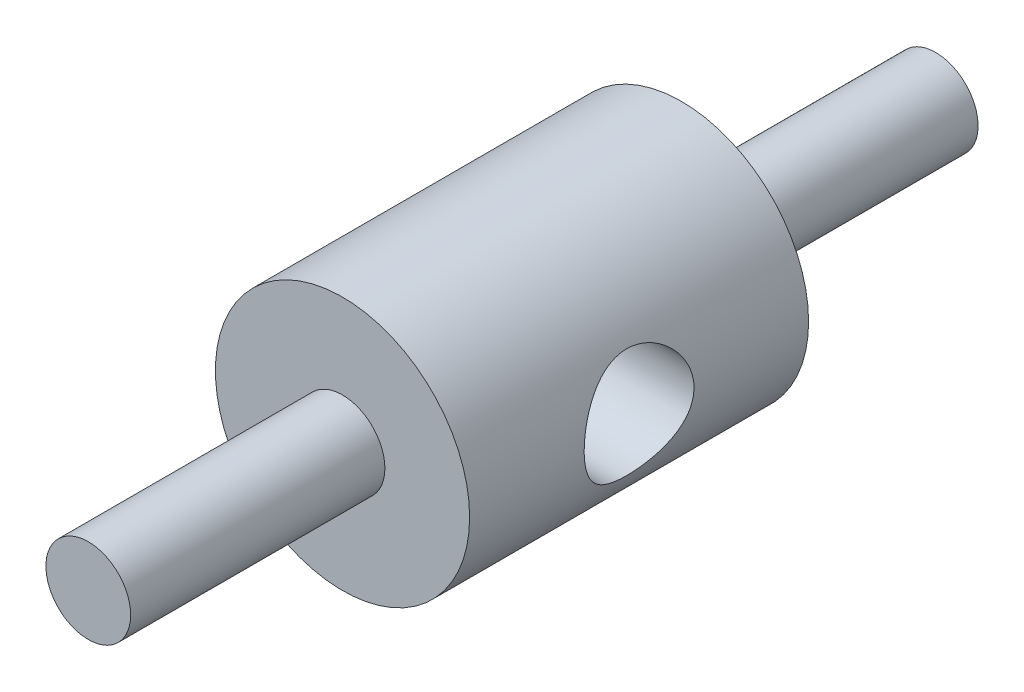
ISO-10303-21;
HEADER;
FILE_DESCRIPTION(('STEP AP214'),'2;1');
FILE_NAME('part.step','',(''),(''),'','','');
FILE_SCHEMA(('AUTOMOTIVE_DESIGN { 1 0 10303 214 1 1 1 1 }'));
ENDSEC;
DATA;
#1=APPLICATION_CONTEXT('core data for automotive mechanical design processes');
#2=APPLICATION_PROTOCOL_DEFINITION('international standard','automotive_design',2000,#1);
#3=PRODUCT_CONTEXT('',#1,'mechanical');
#4=PRODUCT('Part','Part','',(#3));
#5=PRODUCT_RELATED_PRODUCT_CATEGORY('part','',(#4));
#6=PRODUCT_DEFINITION_FORMATION('','',#4);
#7=PRODUCT_DEFINITION_CONTEXT('part definition',#1,'design');
#8=PRODUCT_DEFINITION('design','',#6,#7);
#9=PRODUCT_DEFINITION_SHAPE('','',#8);
#10=(LENGTH_UNIT() NAMED_UNIT(*) SI_UNIT(.MILLI.,.METRE.));
#11=(NAMED_UNIT(*) PLANE_ANGLE_UNIT() SI_UNIT($,.RADIAN.));
#12=(NAMED_UNIT(*) SI_UNIT($,.STERADIAN.) SOLID_ANGLE_UNIT());
#13=UNCERTAINTY_MEASURE_WITH_UNIT(LENGTH_MEASURE(1.E-05),#10,'distance_accuracy_value','');
#14=(GEOMETRIC_REPRESENTATION_CONTEXT(3) GLOBAL_UNCERTAINTY_ASSIGNED_CONTEXT((#13)) GLOBAL_UNIT_ASSIGNED_CONTEXT((#10,
#11,#12)) REPRESENTATION_CONTEXT('',''));
#15=CARTESIAN_POINT('',(0.,0.,0.));
#16=DIRECTION('',(0.,0.,1.));
#17=DIRECTION('',(1.,0.,0.));
#18=AXIS2_PLACEMENT_3D('',#15,#16,#17);
#19=CARTESIAN_POINT('',(0.,0.,-15.875));
#20=DIRECTION('',(0.,0.,1.));
#21=DIRECTION('',(1.,0.,0.));
#22=AXIS2_PLACEMENT_3D('',#19,#20,#21);
#23=CYLINDRICAL_SURFACE('',#22,1.5875);
#24=CARTESIAN_POINT('',(0.,0.,-15.875));
#25=DIRECTION('',(0.,0.,-1.));
#26=DIRECTION('',(-1.,0.,0.));
#27=AXIS2_PLACEMENT_3D('',#24,#25,#26);
#28=CIRCLE('',#27,1.5875);
#29=CARTESIAN_POINT('',(-1.5875,0.,-15.875));
#30=VERTEX_POINT('',#29);
#31=EDGE_CURVE('E11',#30,#30,#28,.T.);
#32=ORIENTED_EDGE('',*,*,#31,.F.);
#33=EDGE_LOOP('',(#32));
#34=FACE_BOUND('',#33,.T.);
#35=CARTESIAN_POINT('',(0.,0.,-3.175));
#36=DIRECTION('',(0.,0.,-1.));
#37=DIRECTION('',(-1.,0.,0.));
#38=AXIS2_PLACEMENT_3D('',#35,#36,#37);
#39=CIRCLE('',#38,1.5875);
#40=CARTESIAN_POINT('',(-1.5875,0.,-3.175));
#41=VERTEX_POINT('',#40);
#42=EDGE_CURVE('E373',#41,#41,#39,.T.);
#43=ORIENTED_EDGE('',*,*,#42,.T.);
#44=EDGE_LOOP('',(#43));
#45=FACE_BOUND('',#44,.T.);
#46=ADVANCED_FACE('F367',(#34,#45),#23,.T.);
#47=CARTESIAN_POINT('',(0.,0.,-15.875));
#48=DIRECTION('',(0.,0.,-1.));
#49=DIRECTION('',(-1.,0.,0.));
#50=AXIS2_PLACEMENT_3D('',#47,#48,#49);
#51=PLANE('',#50);
#52=ORIENTED_EDGE('',*,*,#31,.T.);
#53=EDGE_LOOP('',(#52));
#54=FACE_BOUND('',#53,.T.);
#55=ADVANCED_FACE('F382',(#54),#51,.T.);
#56=CARTESIAN_POINT('',(0.,0.,-3.175));
#57=DIRECTION('',(0.,0.,-1.));
#58=DIRECTION('',(-1.,0.,0.));
#59=AXIS2_PLACEMENT_3D('',#56,#57,#58);
#60=PLANE('',#59);
#61=ORIENTED_EDGE('',*,*,#42,.F.);
#62=EDGE_LOOP('',(#61));
#63=FACE_BOUND('',#62,.T.);
#64=ADVANCED_FACE('F380',(#63),#60,.F.);
#65=CLOSED_SHELL('',(#46,#55,#64));
#66=MANIFOLD_SOLID_BREP('B2',#65);
#67=CARTESIAN_POINT('',(0.,0.,15.875));
#68=DIRECTION('',(0.,0.,-1.));
#69=DIRECTION('',(-1.,0.,0.));
#70=AXIS2_PLACEMENT_3D('',#67,#68,#69);
#71=CYLINDRICAL_SURFACE('',#70,1.5875);
#72=CARTESIAN_POINT('',(0.,0.,15.875));
#73=DIRECTION('',(0.,0.,1.));
#74=DIRECTION('',(1.,0.,0.));
#75=AXIS2_PLACEMENT_3D('',#72,#73,#74);
#76=CIRCLE('',#75,1.5875);
#77=CARTESIAN_POINT('',(1.5875,0.,15.875));
#78=VERTEX_POINT('',#77);
#79=EDGE_CURVE('E366',#78,#78,#76,.T.);
#80=ORIENTED_EDGE('',*,*,#79,.F.);
#81=EDGE_LOOP('',(#80));
#82=FACE_BOUND('',#81,.T.);
#83=CARTESIAN_POINT('',(0.,0.,3.175));
#84=DIRECTION('',(0.,0.,1.));
#85=DIRECTION('',(1.,0.,0.));
#86=AXIS2_PLACEMENT_3D('',#83,#84,#85);
#87=CIRCLE('',#86,1.5875);
#88=CARTESIAN_POINT('',(1.5875,0.,3.175));
#89=VERTEX_POINT('',#88);
#90=EDGE_CURVE('E414',#89,#89,#87,.T.);
#91=ORIENTED_EDGE('',*,*,#90,.T.);
#92=EDGE_LOOP('',(#91));
#93=FACE_BOUND('',#92,.T.);
#94=ADVANCED_FACE('F408',(#82,#93),#71,.T.);
#95=CARTESIAN_POINT('',(0.,0.,15.875));
#96=DIRECTION('',(0.,0.,1.));
#97=DIRECTION('',(1.,0.,0.));
#98=AXIS2_PLACEMENT_3D('',#95,#96,#97);
#99=PLANE('',#98);
#100=ORIENTED_EDGE('',*,*,#79,.T.);
#101=EDGE_LOOP('',(#100));
#102=FACE_BOUND('',#101,.T.);
#103=ADVANCED_FACE('F423',(#102),#99,.T.);
#104=CARTESIAN_POINT('',(0.,0.,3.175));
#105=DIRECTION('',(0.,0.,1.));
#106=DIRECTION('',(1.,0.,0.));
#107=AXIS2_PLACEMENT_3D('',#104,#105,#106);
#108=PLANE('',#107);
#109=ORIENTED_EDGE('',*,*,#90,.F.);
#110=EDGE_LOOP('',(#109));
#111=FACE_BOUND('',#110,.T.);
#112=ADVANCED_FACE('F421',(#111),#108,.F.);
#113=CLOSED_SHELL('',(#94,#103,#112));
#114=MANIFOLD_SOLID_BREP('B6',#113);
#115=CARTESIAN_POINT('',(0.,0.,6.35));
#116=DIRECTION('',(0.,0.,-1.));
#117=DIRECTION('',(-1.,0.,0.));
#118=AXIS2_PLACEMENT_3D('',#115,#116,#117);
#119=CYLINDRICAL_SURFACE('',#118,4.7625);
#120=CARTESIAN_POINT('',(4.7625,0.,2.0574));
#121=CARTESIAN_POINT('',(4.76249630084185,0.109842798349617,2.05739540832976));
#122=CARTESIAN_POINT('',(4.75865708939244,0.219865673510113,2.04855164289537));
#123=CARTESIAN_POINT('',(4.74368279308816,0.436763610989301,2.01351891758661));
#124=CARTESIAN_POINT('',(4.73252947442638,0.543630106924611,1.98728660692131));
#125=CARTESIAN_POINT('',(4.7041143699832,0.750733862169535,1.91863212350494));
#126=CARTESIAN_POINT('',(4.6868739089983,0.850992832564509,1.87626642987253));
#127=CARTESIAN_POINT('',(4.64794719892738,1.04287619039142,1.77679244708001));
#128=CARTESIAN_POINT('',(4.6262621134335,1.13450282860188,1.71968801547411));
#129=CARTESIAN_POINT('',(4.57930702388083,1.31154315551013,1.58915849945861));
#130=CARTESIAN_POINT('',(4.55391402647986,1.39643862372228,1.51507521465793));
#131=CARTESIAN_POINT('',(4.50291379723748,1.55305197406434,1.35408568424591));
#132=CARTESIAN_POINT('',(4.47730645306446,1.62476242700361,1.26717225881817));
#133=CARTESIAN_POINT('',(4.42722714365731,1.7567935635284,1.07733068923681));
#134=CARTESIAN_POINT('',(4.40289039361361,1.8162938526603,0.973792496851527));
#135=CARTESIAN_POINT('',(4.36007795554826,1.9168028093979,0.756978537327528));
#136=CARTESIAN_POINT('',(4.34159902855325,1.95782170125063,0.643708195593708));
#137=CARTESIAN_POINT('',(4.31393584477589,2.0180231973088,0.416609772980543));
#138=CARTESIAN_POINT('',(4.30432808016021,2.0382069098963,0.303100753304886));
#139=CARTESIAN_POINT('',(4.29428806614494,2.05928321824386,0.0739320196735605));
#140=CARTESIAN_POINT('',(4.29385019336116,2.06018763692775,-0.0417263326526995));
#141=CARTESIAN_POINT('',(4.30184379029792,2.04342959069648,-0.261579085892335));
#142=CARTESIAN_POINT('',(4.30953702013773,2.02731262599223,-0.365923699835914));
#143=CARTESIAN_POINT('',(4.33167039518387,1.97957637081651,-0.570249152346402));
#144=CARTESIAN_POINT('',(4.34611195045138,1.94795384039222,-0.670229074135601));
#145=CARTESIAN_POINT('',(4.38044672824831,1.86947971495295,-0.865604774526825));
#146=CARTESIAN_POINT('',(4.40045276616734,1.82230876385313,-0.960851557020356));
#147=CARTESIAN_POINT('',(4.44364081785537,1.7143045416096,-1.14246614974712));
#148=CARTESIAN_POINT('',(4.46682413191984,1.65346567034017,-1.2288302993146));
#149=CARTESIAN_POINT('',(4.51633226408253,1.51332553664104,-1.39854567903536));
#150=CARTESIAN_POINT('',(4.54275043982815,1.43284436712991,-1.480898276415));
#151=CARTESIAN_POINT('',(4.59397464191792,1.2589728219181,-1.63128733213402));
#152=CARTESIAN_POINT('',(4.61878023126121,1.16557896822334,-1.6993199209256));
#153=CARTESIAN_POINT('',(4.6648057627772,0.965304055021186,-1.82075471364087));
#154=CARTESIAN_POINT('',(4.6859132762113,0.85813118892503,-1.87372147606295));
#155=CARTESIAN_POINT('',(4.72128801967978,0.635250483949021,-1.96051772407691));
#156=CARTESIAN_POINT('',(4.7355593197189,0.519547770864031,-1.99435859861224));
#157=CARTESIAN_POINT('',(4.75487565325737,0.291211797097482,-2.03978474043381));
#158=CARTESIAN_POINT('',(4.7604744356568,0.178891682792,-2.05270838074941));
#159=CARTESIAN_POINT('',(4.7636046613426,-0.0464440960296923,-2.05995944963294));
#160=CARTESIAN_POINT('',(4.76113864669104,-0.159459530169026,-2.05429273796577));
#161=CARTESIAN_POINT('',(4.74877140933018,-0.37651624923885,-2.02545540256952));
#162=CARTESIAN_POINT('',(4.73928044672766,-0.480711922667926,-2.00325020247669));
#163=CARTESIAN_POINT('',(4.71426965320115,-0.683768867600789,-1.94333864491278));
#164=CARTESIAN_POINT('',(4.69874907568576,-0.782629476785826,-1.90563036780543));
#165=CARTESIAN_POINT('',(4.66254803425499,-0.975708094433959,-1.81456304993128));
#166=CARTESIAN_POINT('',(4.64172149958225,-1.06968452681714,-1.76075180718947));
#167=CARTESIAN_POINT('',(4.59709652056074,-1.2476127356194,-1.63950001386738));
#168=CARTESIAN_POINT('',(4.57329680256838,-1.33156018552009,-1.57205361459674));
#169=CARTESIAN_POINT('',(4.52301836208381,-1.49380967154924,-1.41942281199307));
#170=CARTESIAN_POINT('',(4.49647398496952,-1.57118841139653,-1.33327610810505));
#171=CARTESIAN_POINT('',(4.44528090806956,-1.71067758994202,-1.14884689269331));
#172=CARTESIAN_POINT('',(4.42063276661023,-1.77278354346482,-1.05056082889056));
#173=CARTESIAN_POINT('',(4.37572909596306,-1.88093302408531,-0.842040246479254));
#174=CARTESIAN_POINT('',(4.35556637305955,-1.92664739399772,-0.731613497956871));
#175=CARTESIAN_POINT('',(4.32311419436033,-1.9984167526458,-0.503477808699871));
#176=CARTESIAN_POINT('',(4.31081758785439,-2.0244896003917,-0.385775588815177));
#177=CARTESIAN_POINT('',(4.2966376823494,-2.05440009551503,-0.156748939070271));
#178=CARTESIAN_POINT('',(4.29398832709679,-2.05987469495492,-0.045685079907311));
#179=CARTESIAN_POINT('',(4.29734204500109,-2.0528698189677,0.175729709267731));
#180=CARTESIAN_POINT('',(4.30334352903047,-2.04039364103353,0.28608076647878));
#181=CARTESIAN_POINT('',(4.32260066982637,-1.99924934754477,0.4967966782491));
#182=CARTESIAN_POINT('',(4.33544902911308,-1.97148769748755,0.597379468922897));
#183=CARTESIAN_POINT('',(4.36660310007185,-1.90148451244698,0.792464157205721));
#184=CARTESIAN_POINT('',(4.38491036853884,-1.85923884633477,0.886964310782429));
#185=CARTESIAN_POINT('',(4.42633494898216,-1.75843867276114,1.07365548264032));
#186=CARTESIAN_POINT('',(4.44968127000695,-1.69903034794061,1.16533363147339));
#187=CARTESIAN_POINT('',(4.49796510480829,-1.56673898686084,1.33793017773684));
#188=CARTESIAN_POINT('',(4.5229032317293,-1.49385073753469,1.41884439156459));
#189=CARTESIAN_POINT('',(4.57397684020983,-1.3297003323874,1.57435030411899));
#190=CARTESIAN_POINT('',(4.6000465007146,-1.23742999686925,1.64790456055206));
#191=CARTESIAN_POINT('',(4.64845446396633,-1.04091477485433,1.77856944839271));
#192=CARTESIAN_POINT('',(4.67079107268974,-0.936664487986347,1.83567262291654));
#193=CARTESIAN_POINT('',(4.70895781942287,-0.720422738266816,1.9307107313542));
#194=CARTESIAN_POINT('',(4.7248742803373,-0.6085593791689,1.9689016642161));
#195=CARTESIAN_POINT('',(4.74875716177517,-0.379333728812668,2.02555031869964));
#196=CARTESIAN_POINT('',(4.75674812780327,-0.26198960132407,2.04406897870637));
#197=CARTESIAN_POINT('',(4.76104788877183,-0.120054805902528,2.05403592331502));
#198=CARTESIAN_POINT('',(4.76159156267155,-0.0960667562735857,2.05529636095424));
#199=CARTESIAN_POINT('',(4.76231802426085,-0.0480553445113252,2.0569789046454));
#200=CARTESIAN_POINT('',(4.76250080932117,-0.0240319821220122,2.05740100458964));
#201=CARTESIAN_POINT('',(4.7625,0.,2.0574));
#202=B_SPLINE_CURVE_WITH_KNOTS('',3,(#120,#121,#122,#123,#124,#125,#126,#127,#128,#129,#130,
#131,#132,#133,#134,#135,#136,#137,#138,#139,#140,#141,#142,#143,#144,#145,#146,#147,#148,#149,
#150,#151,#152,#153,#154,#155,#156,#157,#158,#159,#160,#161,#162,#163,#164,#165,#166,#167,#168,
#169,#170,#171,#172,#173,#174,#175,#176,#177,#178,#179,#180,#181,#182,#183,#184,#185,#186,#187,
#188,#189,#190,#191,#192,#193,#194,#195,#196,#197,#198,#199,#200,#201),.UNSPECIFIED.,.T.,.F.,(4,
2,2,2,2,2,2,2,2,2,2,2,2,2,2,2,2,2,2,2,2,2,2,2,2,2,2,2,2,2,2,2,2,2,2,2,2,2,2,2,4),(0.,
0.329429256291905,0.659682905984324,0.988790889457392,1.31781282304139,1.66282201652796,
2.00802501611573,2.37180108002769,2.73537564851859,3.08052835436271,3.42546939106369,
3.74158029334693,4.05775727649196,4.38088151616555,4.70413839103742,5.05697135272232,
5.40989953475646,5.77217954755118,6.1342436045907,6.4720665504881,6.8097830232636,
7.12919405455366,7.44864464816734,7.77807663347159,8.10765022693688,8.46243870755371,
8.81733125518885,9.17899662822514,9.54033275960004,9.87226086179264,10.2041279977769,
10.5181552992694,10.8322722421948,11.1660083058159,11.4998737055016,11.8606865612139,
12.2216627084054,12.5776091037561,12.9324496471978,13.0045233783766,13.0765976346467),.UNSPECIFIED.);
#203=CARTESIAN_POINT('',(4.7625,0.,2.0574));
#204=VERTEX_POINT('',#203);
#205=EDGE_CURVE('E452',#204,#204,#202,.T.);
#206=ORIENTED_EDGE('',*,*,#205,.T.);
#207=EDGE_LOOP('',(#206));
#208=FACE_BOUND('',#207,.T.);
#209=CARTESIAN_POINT('',(0.,0.,6.35));
#210=DIRECTION('',(0.,0.,1.));
#211=DIRECTION('',(1.,0.,0.));
#212=AXIS2_PLACEMENT_3D('',#209,#210,#211);
#213=CIRCLE('',#212,4.7625);
#214=CARTESIAN_POINT('',(4.7625,0.,6.35));
#215=VERTEX_POINT('',#214);
#216=EDGE_CURVE('E407',#215,#215,#213,.T.);
#217=ORIENTED_EDGE('',*,*,#216,.F.);
#218=EDGE_LOOP('',(#217));
#219=FACE_BOUND('',#218,.T.);
#220=CARTESIAN_POINT('',(0.,0.,-6.35));
#221=DIRECTION('',(0.,0.,1.));
#222=DIRECTION('',(1.,0.,0.));
#223=AXIS2_PLACEMENT_3D('',#220,#221,#222);
#224=CIRCLE('',#223,4.7625);
#225=CARTESIAN_POINT('',(4.7625,0.,-6.35));
#226=VERTEX_POINT('',#225);
#227=EDGE_CURVE('E448',#226,#226,#224,.T.);
#228=ORIENTED_EDGE('',*,*,#227,.T.);
#229=EDGE_LOOP('',(#228));
#230=FACE_BOUND('',#229,.T.);
#231=CARTESIAN_POINT('',(-4.7625,0.,-2.0574));
#232=CARTESIAN_POINT('',(-4.76249630084185,-0.109842798349617,-2.05739540832976));
#233=CARTESIAN_POINT('',(-4.75865708939244,-0.219865673510113,-2.04855164289537));
#234=CARTESIAN_POINT('',(-4.74368279308816,-0.436763610989301,-2.01351891758661));
#235=CARTESIAN_POINT('',(-4.73252947442638,-0.543630106924611,-1.98728660692131));
#236=CARTESIAN_POINT('',(-4.7041143699832,-0.750733862169535,-1.91863212350494));
#237=CARTESIAN_POINT('',(-4.6868739089983,-0.850992832564509,-1.87626642987253));
#238=CARTESIAN_POINT('',(-4.64794719892738,-1.04287619039142,-1.77679244708001));
#239=CARTESIAN_POINT('',(-4.6262621134335,-1.13450282860188,-1.71968801547411));
#240=CARTESIAN_POINT('',(-4.57930702388083,-1.31154315551013,-1.58915849945861));
#241=CARTESIAN_POINT('',(-4.55391402647986,-1.39643862372228,-1.51507521465793));
#242=CARTESIAN_POINT('',(-4.50291379723748,-1.55305197406434,-1.35408568424591));
#243=CARTESIAN_POINT('',(-4.47730645306446,-1.62476242700361,-1.26717225881817));
#244=CARTESIAN_POINT('',(-4.42722714365731,-1.7567935635284,-1.07733068923681));
#245=CARTESIAN_POINT('',(-4.40289039361361,-1.8162938526603,-0.973792496851527));
#246=CARTESIAN_POINT('',(-4.36007795554826,-1.9168028093979,-0.756978537327528));
#247=CARTESIAN_POINT('',(-4.34159902855325,-1.95782170125063,-0.643708195593708));
#248=CARTESIAN_POINT('',(-4.31393584477589,-2.0180231973088,-0.416609772980543));
#249=CARTESIAN_POINT('',(-4.30432808016021,-2.0382069098963,-0.303100753304886));
#250=CARTESIAN_POINT('',(-4.29428806614494,-2.05928321824386,-0.0739320196735605));
#251=CARTESIAN_POINT('',(-4.29385019336116,-2.06018763692775,0.0417263326526995));
#252=CARTESIAN_POINT('',(-4.30184379029792,-2.04342959069648,0.261579085892335));
#253=CARTESIAN_POINT('',(-4.30953702013773,-2.02731262599223,0.365923699835914));
#254=CARTESIAN_POINT('',(-4.33167039518387,-1.97957637081651,0.570249152346402));
#255=CARTESIAN_POINT('',(-4.34611195045138,-1.94795384039222,0.670229074135601));
#256=CARTESIAN_POINT('',(-4.38044672824831,-1.86947971495295,0.865604774526825));
#257=CARTESIAN_POINT('',(-4.40045276616734,-1.82230876385313,0.960851557020356));
#258=CARTESIAN_POINT('',(-4.44364081785537,-1.7143045416096,1.14246614974712));
#259=CARTESIAN_POINT('',(-4.46682413191984,-1.65346567034017,1.2288302993146));
#260=CARTESIAN_POINT('',(-4.51633226408253,-1.51332553664104,1.39854567903536));
#261=CARTESIAN_POINT('',(-4.54275043982815,-1.43284436712991,1.480898276415));
#262=CARTESIAN_POINT('',(-4.59397464191792,-1.2589728219181,1.63128733213402));
#263=CARTESIAN_POINT('',(-4.61878023126121,-1.16557896822334,1.6993199209256));
#264=CARTESIAN_POINT('',(-4.6648057627772,-0.965304055021186,1.82075471364087));
#265=CARTESIAN_POINT('',(-4.6859132762113,-0.85813118892503,1.87372147606295));
#266=CARTESIAN_POINT('',(-4.72128801967978,-0.635250483949021,1.96051772407691));
#267=CARTESIAN_POINT('',(-4.7355593197189,-0.519547770864031,1.99435859861224));
#268=CARTESIAN_POINT('',(-4.75487565325737,-0.291211797097482,2.03978474043381));
#269=CARTESIAN_POINT('',(-4.7604744356568,-0.178891682792,2.05270838074941));
#270=CARTESIAN_POINT('',(-4.7636046613426,0.0464440960296923,2.05995944963294));
#271=CARTESIAN_POINT('',(-4.76113864669104,0.159459530169026,2.05429273796577));
#272=CARTESIAN_POINT('',(-4.74877140933018,0.37651624923885,2.02545540256952));
#273=CARTESIAN_POINT('',(-4.73928044672766,0.480711922667926,2.00325020247669));
#274=CARTESIAN_POINT('',(-4.71426965320115,0.683768867600789,1.94333864491278));
#275=CARTESIAN_POINT('',(-4.69874907568576,0.782629476785826,1.90563036780543));
#276=CARTESIAN_POINT('',(-4.66254803425499,0.975708094433959,1.81456304993128));
#277=CARTESIAN_POINT('',(-4.64172149958225,1.06968452681714,1.76075180718947));
#278=CARTESIAN_POINT('',(-4.59709652056074,1.2476127356194,1.63950001386738));
#279=CARTESIAN_POINT('',(-4.57329680256838,1.33156018552009,1.57205361459674));
#280=CARTESIAN_POINT('',(-4.52301836208381,1.49380967154924,1.41942281199307));
#281=CARTESIAN_POINT('',(-4.49647398496952,1.57118841139653,1.33327610810505));
#282=CARTESIAN_POINT('',(-4.44528090806956,1.71067758994202,1.14884689269331));
#283=CARTESIAN_POINT('',(-4.42063276661023,1.77278354346482,1.05056082889056));
#284=CARTESIAN_POINT('',(-4.37572909596306,1.88093302408531,0.842040246479254));
#285=CARTESIAN_POINT('',(-4.35556637305955,1.92664739399772,0.731613497956871));
#286=CARTESIAN_POINT('',(-4.32311419436033,1.9984167526458,0.503477808699871));
#287=CARTESIAN_POINT('',(-4.31081758785439,2.0244896003917,0.385775588815177));
#288=CARTESIAN_POINT('',(-4.2966376823494,2.05440009551503,0.156748939070271));
#289=CARTESIAN_POINT('',(-4.29398832709679,2.05987469495492,0.045685079907311));
#290=CARTESIAN_POINT('',(-4.29734204500109,2.0528698189677,-0.175729709267731));
#291=CARTESIAN_POINT('',(-4.30334352903047,2.04039364103353,-0.28608076647878));
#292=CARTESIAN_POINT('',(-4.32260066982637,1.99924934754477,-0.4967966782491));
#293=CARTESIAN_POINT('',(-4.33544902911308,1.97148769748755,-0.597379468922897));
#294=CARTESIAN_POINT('',(-4.36660310007185,1.90148451244698,-0.792464157205721));
#295=CARTESIAN_POINT('',(-4.38491036853884,1.85923884633477,-0.886964310782429));
#296=CARTESIAN_POINT('',(-4.42633494898216,1.75843867276114,-1.07365548264032));
#297=CARTESIAN_POINT('',(-4.44968127000695,1.69903034794061,-1.16533363147339));
#298=CARTESIAN_POINT('',(-4.49796510480829,1.56673898686084,-1.33793017773684));
#299=CARTESIAN_POINT('',(-4.5229032317293,1.49385073753469,-1.41884439156459));
#300=CARTESIAN_POINT('',(-4.57397684020983,1.3297003323874,-1.57435030411899));
#301=CARTESIAN_POINT('',(-4.6000465007146,1.23742999686925,-1.64790456055206));
#302=CARTESIAN_POINT('',(-4.64845446396633,1.04091477485433,-1.77856944839271));
#303=CARTESIAN_POINT('',(-4.67079107268974,0.936664487986347,-1.83567262291654));
#304=CARTESIAN_POINT('',(-4.70895781942287,0.720422738266816,-1.9307107313542));
#305=CARTESIAN_POINT('',(-4.7248742803373,0.6085593791689,-1.9689016642161));
#306=CARTESIAN_POINT('',(-4.74875716177517,0.379333728812668,-2.02555031869964));
#307=CARTESIAN_POINT('',(-4.75674812780327,0.26198960132407,-2.04406897870637));
#308=CARTESIAN_POINT('',(-4.76104788877183,0.120054805902528,-2.05403592331502));
#309=CARTESIAN_POINT('',(-4.76159156267155,0.0960667562735857,-2.05529636095424));
#310=CARTESIAN_POINT('',(-4.76231802426085,0.0480553445113252,-2.0569789046454));
#311=CARTESIAN_POINT('',(-4.76250080932117,0.0240319821220122,-2.05740100458964));
#312=CARTESIAN_POINT('',(-4.7625,0.,-2.0574));
#313=B_SPLINE_CURVE_WITH_KNOTS('',3,(#231,#232,#233,#234,#235,#236,#237,#238,#239,#240,#241,
#242,#243,#244,#245,#246,#247,#248,#249,#250,#251,#252,#253,#254,#255,#256,#257,#258,#259,#260,
#261,#262,#263,#264,#265,#266,#267,#268,#269,#270,#271,#272,#273,#274,#275,#276,#277,#278,#279,
#280,#281,#282,#283,#284,#285,#286,#287,#288,#289,#290,#291,#292,#293,#294,#295,#296,#297,#298,
#299,#300,#301,#302,#303,#304,#305,#306,#307,#308,#309,#310,#311,#312),.UNSPECIFIED.,.T.,.F.,(4,
2,2,2,2,2,2,2,2,2,2,2,2,2,2,2,2,2,2,2,2,2,2,2,2,2,2,2,2,2,2,2,2,2,2,2,2,2,2,2,4),(0.,
0.329429256291905,0.659682905984324,0.988790889457392,1.31781282304139,1.66282201652796,
2.00802501611573,2.37180108002769,2.73537564851859,3.08052835436271,3.42546939106369,
3.74158029334693,4.05775727649196,4.38088151616555,4.70413839103742,5.05697135272232,
5.40989953475646,5.77217954755118,6.1342436045907,6.4720665504881,6.8097830232636,
7.12919405455366,7.44864464816734,7.77807663347159,8.10765022693688,8.46243870755371,
8.81733125518885,9.17899662822514,9.54033275960004,9.87226086179264,10.2041279977769,
10.5181552992694,10.8322722421948,11.1660083058159,11.4998737055016,11.8606865612139,
12.2216627084054,12.5776091037561,12.9324496471978,13.0045233783766,13.0765976346467),.UNSPECIFIED.);
#314=CARTESIAN_POINT('',(-4.7625,0.,-2.0574));
#315=VERTEX_POINT('',#314);
#316=EDGE_CURVE('E456',#315,#315,#313,.T.);
#317=ORIENTED_EDGE('',*,*,#316,.F.);
#318=EDGE_LOOP('',(#317));
#319=FACE_BOUND('',#318,.T.);
#320=ADVANCED_FACE('F442',(#208,#219,#230,#319),#119,.T.);
#321=CARTESIAN_POINT('',(0.,0.,6.35));
#322=DIRECTION('',(0.,0.,1.));
#323=DIRECTION('',(1.,0.,0.));
#324=AXIS2_PLACEMENT_3D('',#321,#322,#323);
#325=PLANE('',#324);
#326=ORIENTED_EDGE('',*,*,#216,.T.);
#327=EDGE_LOOP('',(#326));
#328=FACE_BOUND('',#327,.T.);
#329=ADVANCED_FACE('F477',(#328),#325,.T.);
#330=CARTESIAN_POINT('',(0.,0.,-6.35));
#331=DIRECTION('',(0.,0.,1.));
#332=DIRECTION('',(1.,0.,0.));
#333=AXIS2_PLACEMENT_3D('',#330,#331,#332);
#334=PLANE('',#333);
#335=ORIENTED_EDGE('',*,*,#227,.F.);
#336=EDGE_LOOP('',(#335));
#337=FACE_BOUND('',#336,.T.);
#338=ADVANCED_FACE('F474',(#337),#334,.F.);
#339=CARTESIAN_POINT('',(4.7635,0.,0.));
#340=DIRECTION('',(-1.,0.,0.));
#341=DIRECTION('',(0.,0.,1.));
#342=AXIS2_PLACEMENT_3D('',#339,#340,#341);
#343=CYLINDRICAL_SURFACE('',#342,2.0574);
#344=ORIENTED_EDGE('',*,*,#205,.F.);
#345=EDGE_LOOP('',(#344));
#346=FACE_BOUND('',#345,.T.);
#347=ORIENTED_EDGE('',*,*,#316,.T.);
#348=EDGE_LOOP('',(#347));
#349=FACE_BOUND('',#348,.T.);
#350=ADVANCED_FACE('F467',(#346,#349),#343,.F.);
#351=CLOSED_SHELL('',(#320,#329,#338,#350));
#352=MANIFOLD_SOLID_BREP('B361',#351);
#353=ADVANCED_BREP_SHAPE_REPRESENTATION('',(#18,#66,#114,#352),#14);
#354=SHAPE_DEFINITION_REPRESENTATION(#9,#353);
ENDSEC;
END-ISO-10303-21;
